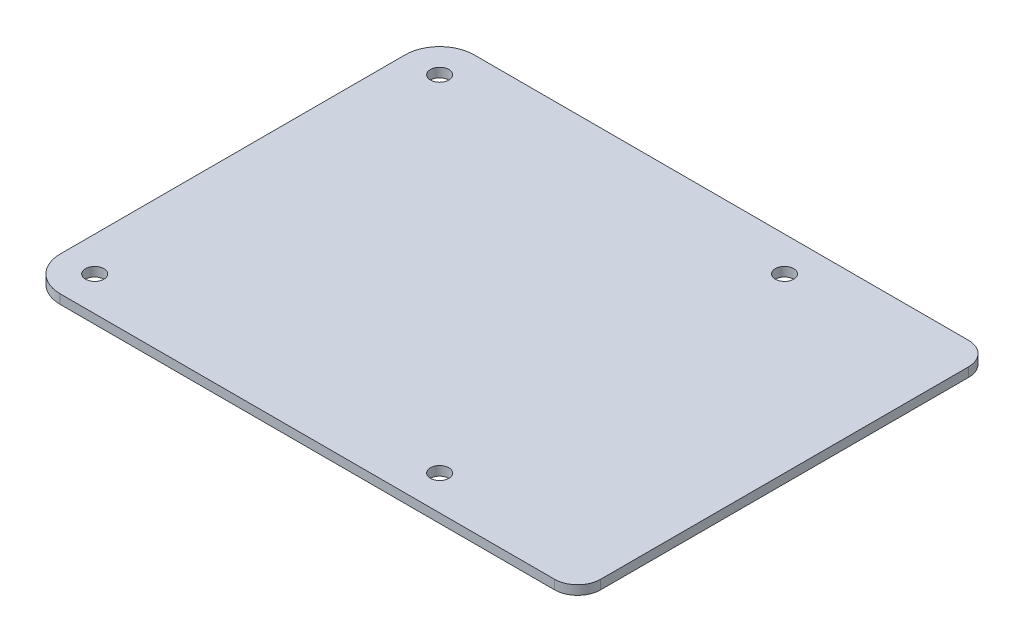
ISO-10303-21;
HEADER;
FILE_DESCRIPTION(('STEP AP214'),'2;1');
FILE_NAME('part.step','',(''),(''),'','','');
FILE_SCHEMA(('AUTOMOTIVE_DESIGN { 1 0 10303 214 1 1 1 1 }'));
ENDSEC;
DATA;
#1=APPLICATION_CONTEXT('core data for automotive mechanical design processes');
#2=APPLICATION_PROTOCOL_DEFINITION('international standard','automotive_design',2000,#1);
#3=PRODUCT_CONTEXT('',#1,'mechanical');
#4=PRODUCT('Part','Part','',(#3));
#5=PRODUCT_RELATED_PRODUCT_CATEGORY('part','',(#4));
#6=PRODUCT_DEFINITION_FORMATION('','',#4);
#7=PRODUCT_DEFINITION_CONTEXT('part definition',#1,'design');
#8=PRODUCT_DEFINITION('design','',#6,#7);
#9=PRODUCT_DEFINITION_SHAPE('','',#8);
#10=(LENGTH_UNIT() NAMED_UNIT(*) SI_UNIT(.MILLI.,.METRE.));
#11=(NAMED_UNIT(*) PLANE_ANGLE_UNIT() SI_UNIT($,.RADIAN.));
#12=(NAMED_UNIT(*) SI_UNIT($,.STERADIAN.) SOLID_ANGLE_UNIT());
#13=UNCERTAINTY_MEASURE_WITH_UNIT(LENGTH_MEASURE(1.E-05),#10,'distance_accuracy_value','');
#14=(GEOMETRIC_REPRESENTATION_CONTEXT(3) GLOBAL_UNCERTAINTY_ASSIGNED_CONTEXT((#13)) GLOBAL_UNIT_ASSIGNED_CONTEXT((#10,
#11,#12)) REPRESENTATION_CONTEXT('',''));
#15=CARTESIAN_POINT('',(0.,0.,0.));
#16=DIRECTION('',(0.,0.,1.));
#17=DIRECTION('',(1.,0.,0.));
#18=AXIS2_PLACEMENT_3D('',#15,#16,#17);
#19=CARTESIAN_POINT('',(-28.,1.6,-30.));
#20=DIRECTION('',(0.,1.,0.));
#21=DIRECTION('',(0.,0.,1.));
#22=AXIS2_PLACEMENT_3D('',#19,#20,#21);
#23=PLANE('',#22);
#24=CARTESIAN_POINT('',(32.,1.6,30.));
#25=DIRECTION('',(0.,1.,0.));
#26=DIRECTION('',(0.,0.,1.));
#27=AXIS2_PLACEMENT_3D('',#24,#25,#26);
#28=CIRCLE('',#27,1.6);
#29=CARTESIAN_POINT('',(32.,1.6,31.6));
#30=VERTEX_POINT('',#29);
#31=EDGE_CURVE('E193',#30,#30,#28,.T.);
#32=ORIENTED_EDGE('',*,*,#31,.F.);
#33=EDGE_LOOP('',(#32));
#34=FACE_BOUND('',#33,.T.);
#35=CARTESIAN_POINT('',(-28.,1.6,-30.));
#36=DIRECTION('',(0.,1.,0.));
#37=DIRECTION('',(0.,0.,1.));
#38=AXIS2_PLACEMENT_3D('',#35,#36,#37);
#39=CIRCLE('',#38,1.6);
#40=CARTESIAN_POINT('',(-28.,1.6,-28.4));
#41=VERTEX_POINT('',#40);
#42=EDGE_CURVE('E181',#41,#41,#39,.T.);
#43=ORIENTED_EDGE('',*,*,#42,.F.);
#44=EDGE_LOOP('',(#43));
#45=FACE_BOUND('',#44,.T.);
#46=DIRECTION('',(0.,0.,-1.));
#47=VECTOR('',#46,1.);
#48=CARTESIAN_POINT('',(62.,1.6,36.));
#49=LINE('',#48,#47);
#50=CARTESIAN_POINT('',(62.,1.6,32.));
#51=VERTEX_POINT('',#50);
#52=CARTESIAN_POINT('',(62.,1.6,-32.));
#53=VERTEX_POINT('',#52);
#54=EDGE_CURVE('E143',#51,#53,#49,.T.);
#55=ORIENTED_EDGE('',*,*,#54,.T.);
#56=CARTESIAN_POINT('',(58.,1.6,-32.));
#57=DIRECTION('',(0.,1.,0.));
#58=DIRECTION('',(0.,0.,1.));
#59=AXIS2_PLACEMENT_3D('',#56,#57,#58);
#60=CIRCLE('',#59,4.);
#61=CARTESIAN_POINT('',(58.,1.6,-36.));
#62=VERTEX_POINT('',#61);
#63=EDGE_CURVE('E41',#53,#62,#60,.T.);
#64=ORIENTED_EDGE('',*,*,#63,.T.);
#65=DIRECTION('',(-1.,0.,0.));
#66=VECTOR('',#65,1.);
#67=CARTESIAN_POINT('',(-28.,1.6,-36.));
#68=LINE('',#67,#66);
#69=CARTESIAN_POINT('',(-28.,1.6,-36.));
#70=VERTEX_POINT('',#69);
#71=EDGE_CURVE('E116',#62,#70,#68,.T.);
#72=ORIENTED_EDGE('',*,*,#71,.T.);
#73=CARTESIAN_POINT('',(-28.,1.6,-30.));
#74=DIRECTION('',(0.,1.,0.));
#75=DIRECTION('',(0.,0.,1.));
#76=AXIS2_PLACEMENT_3D('',#73,#74,#75);
#77=CIRCLE('',#76,5.99999999999999);
#78=CARTESIAN_POINT('',(-34.,1.6,-30.));
#79=VERTEX_POINT('',#78);
#80=EDGE_CURVE('E111',#70,#79,#77,.T.);
#81=ORIENTED_EDGE('',*,*,#80,.T.);
#82=DIRECTION('',(0.,0.,1.));
#83=VECTOR('',#82,1.);
#84=CARTESIAN_POINT('',(-34.,1.6,-30.));
#85=LINE('',#84,#83);
#86=CARTESIAN_POINT('',(-34.,1.6,30.));
#87=VERTEX_POINT('',#86);
#88=EDGE_CURVE('E100',#79,#87,#85,.T.);
#89=ORIENTED_EDGE('',*,*,#88,.T.);
#90=CARTESIAN_POINT('',(-28.,1.6,30.));
#91=DIRECTION('',(0.,1.,0.));
#92=DIRECTION('',(0.,0.,1.));
#93=AXIS2_PLACEMENT_3D('',#90,#91,#92);
#94=CIRCLE('',#93,6.);
#95=CARTESIAN_POINT('',(-28.,1.6,36.));
#96=VERTEX_POINT('',#95);
#97=EDGE_CURVE('E110',#87,#96,#94,.T.);
#98=ORIENTED_EDGE('',*,*,#97,.T.);
#99=DIRECTION('',(1.,0.,0.));
#100=VECTOR('',#99,1.);
#101=CARTESIAN_POINT('',(-28.,1.6,36.));
#102=LINE('',#101,#100);
#103=CARTESIAN_POINT('',(58.,1.6,36.));
#104=VERTEX_POINT('',#103);
#105=EDGE_CURVE('E170',#96,#104,#102,.T.);
#106=ORIENTED_EDGE('',*,*,#105,.T.);
#107=CARTESIAN_POINT('',(58.,1.6,32.));
#108=DIRECTION('',(0.,1.,0.));
#109=DIRECTION('',(0.,0.,1.));
#110=AXIS2_PLACEMENT_3D('',#107,#108,#109);
#111=CIRCLE('',#110,4.);
#112=EDGE_CURVE('E141',#104,#51,#111,.T.);
#113=ORIENTED_EDGE('',*,*,#112,.T.);
#114=EDGE_LOOP('',(#55,#64,#72,#81,#89,#98,#106,#113));
#115=FACE_BOUND('',#114,.T.);
#116=CARTESIAN_POINT('',(32.,1.6,-30.));
#117=DIRECTION('',(0.,1.,0.));
#118=DIRECTION('',(0.,0.,1.));
#119=AXIS2_PLACEMENT_3D('',#116,#117,#118);
#120=CIRCLE('',#119,1.6);
#121=CARTESIAN_POINT('',(32.,1.6,-28.4));
#122=VERTEX_POINT('',#121);
#123=EDGE_CURVE('E187',#122,#122,#120,.T.);
#124=ORIENTED_EDGE('',*,*,#123,.F.);
#125=EDGE_LOOP('',(#124));
#126=FACE_BOUND('',#125,.T.);
#127=CARTESIAN_POINT('',(-28.,1.6,30.));
#128=DIRECTION('',(0.,1.,0.));
#129=DIRECTION('',(0.,0.,1.));
#130=AXIS2_PLACEMENT_3D('',#127,#128,#129);
#131=CIRCLE('',#130,1.6);
#132=CARTESIAN_POINT('',(-28.,1.6,31.6));
#133=VERTEX_POINT('',#132);
#134=EDGE_CURVE('E199',#133,#133,#131,.T.);
#135=ORIENTED_EDGE('',*,*,#134,.F.);
#136=EDGE_LOOP('',(#135));
#137=FACE_BOUND('',#136,.T.);
#138=ADVANCED_FACE('F33',(#34,#45,#115,#126,#137),#23,.T.);
#139=CARTESIAN_POINT('',(-28.,0.,-30.));
#140=DIRECTION('',(0.,1.,0.));
#141=DIRECTION('',(0.,0.,1.));
#142=AXIS2_PLACEMENT_3D('',#139,#140,#141);
#143=PLANE('',#142);
#144=DIRECTION('',(-1.,0.,0.));
#145=VECTOR('',#144,1.);
#146=CARTESIAN_POINT('',(-28.,0.,-36.));
#147=LINE('',#146,#145);
#148=CARTESIAN_POINT('',(58.,0.,-36.));
#149=VERTEX_POINT('',#148);
#150=CARTESIAN_POINT('',(-28.,0.,-36.));
#151=VERTEX_POINT('',#150);
#152=EDGE_CURVE('E120',#149,#151,#147,.T.);
#153=ORIENTED_EDGE('',*,*,#152,.F.);
#154=CARTESIAN_POINT('',(58.,0.,-32.));
#155=DIRECTION('',(0.,1.,0.));
#156=DIRECTION('',(0.,0.,1.));
#157=AXIS2_PLACEMENT_3D('',#154,#155,#156);
#158=CIRCLE('',#157,4.);
#159=CARTESIAN_POINT('',(62.,0.,-32.));
#160=VERTEX_POINT('',#159);
#161=EDGE_CURVE('E135',#149,#160,#158,.F.);
#162=ORIENTED_EDGE('',*,*,#161,.T.);
#163=DIRECTION('',(0.,0.,-1.));
#164=VECTOR('',#163,1.);
#165=CARTESIAN_POINT('',(62.,0.,36.));
#166=LINE('',#165,#164);
#167=CARTESIAN_POINT('',(62.,0.,32.));
#168=VERTEX_POINT('',#167);
#169=EDGE_CURVE('E156',#168,#160,#166,.T.);
#170=ORIENTED_EDGE('',*,*,#169,.F.);
#171=CARTESIAN_POINT('',(58.,0.,32.));
#172=DIRECTION('',(0.,1.,0.));
#173=DIRECTION('',(0.,0.,1.));
#174=AXIS2_PLACEMENT_3D('',#171,#172,#173);
#175=CIRCLE('',#174,4.);
#176=CARTESIAN_POINT('',(58.,0.,36.));
#177=VERTEX_POINT('',#176);
#178=EDGE_CURVE('E128',#168,#177,#175,.F.);
#179=ORIENTED_EDGE('',*,*,#178,.T.);
#180=DIRECTION('',(1.,0.,0.));
#181=VECTOR('',#180,1.);
#182=CARTESIAN_POINT('',(-28.,0.,36.));
#183=LINE('',#182,#181);
#184=CARTESIAN_POINT('',(-28.,0.,36.));
#185=VERTEX_POINT('',#184);
#186=EDGE_CURVE('E159',#185,#177,#183,.T.);
#187=ORIENTED_EDGE('',*,*,#186,.F.);
#188=CARTESIAN_POINT('',(-28.,0.,30.));
#189=DIRECTION('',(0.,1.,0.));
#190=DIRECTION('',(0.,0.,1.));
#191=AXIS2_PLACEMENT_3D('',#188,#189,#190);
#192=CIRCLE('',#191,6.);
#193=CARTESIAN_POINT('',(-34.,0.,30.));
#194=VERTEX_POINT('',#193);
#195=EDGE_CURVE('E162',#194,#185,#192,.T.);
#196=ORIENTED_EDGE('',*,*,#195,.F.);
#197=DIRECTION('',(0.,0.,1.));
#198=VECTOR('',#197,1.);
#199=CARTESIAN_POINT('',(-34.,0.,-30.));
#200=LINE('',#199,#198);
#201=CARTESIAN_POINT('',(-34.,0.,-30.));
#202=VERTEX_POINT('',#201);
#203=EDGE_CURVE('E180',#202,#194,#200,.T.);
#204=ORIENTED_EDGE('',*,*,#203,.F.);
#205=CARTESIAN_POINT('',(-28.,0.,-30.));
#206=DIRECTION('',(0.,1.,0.));
#207=DIRECTION('',(0.,0.,1.));
#208=AXIS2_PLACEMENT_3D('',#205,#206,#207);
#209=CIRCLE('',#208,5.99999999999999);
#210=EDGE_CURVE('E124',#151,#202,#209,.T.);
#211=ORIENTED_EDGE('',*,*,#210,.F.);
#212=EDGE_LOOP('',(#153,#162,#170,#179,#187,#196,#204,#211));
#213=FACE_BOUND('',#212,.T.);
#214=CARTESIAN_POINT('',(-28.,0.,-30.));
#215=DIRECTION('',(0.,1.,0.));
#216=DIRECTION('',(0.,0.,1.));
#217=AXIS2_PLACEMENT_3D('',#214,#215,#216);
#218=CIRCLE('',#217,1.6);
#219=CARTESIAN_POINT('',(-28.,0.,-28.4));
#220=VERTEX_POINT('',#219);
#221=EDGE_CURVE('E184',#220,#220,#218,.T.);
#222=ORIENTED_EDGE('',*,*,#221,.T.);
#223=EDGE_LOOP('',(#222));
#224=FACE_BOUND('',#223,.T.);
#225=CARTESIAN_POINT('',(32.,0.,-30.));
#226=DIRECTION('',(0.,1.,0.));
#227=DIRECTION('',(0.,0.,1.));
#228=AXIS2_PLACEMENT_3D('',#225,#226,#227);
#229=CIRCLE('',#228,1.6);
#230=CARTESIAN_POINT('',(32.,0.,-28.4));
#231=VERTEX_POINT('',#230);
#232=EDGE_CURVE('E190',#231,#231,#229,.T.);
#233=ORIENTED_EDGE('',*,*,#232,.T.);
#234=EDGE_LOOP('',(#233));
#235=FACE_BOUND('',#234,.T.);
#236=CARTESIAN_POINT('',(32.,0.,30.));
#237=DIRECTION('',(0.,1.,0.));
#238=DIRECTION('',(0.,0.,1.));
#239=AXIS2_PLACEMENT_3D('',#236,#237,#238);
#240=CIRCLE('',#239,1.6);
#241=CARTESIAN_POINT('',(32.,0.,31.6));
#242=VERTEX_POINT('',#241);
#243=EDGE_CURVE('E196',#242,#242,#240,.T.);
#244=ORIENTED_EDGE('',*,*,#243,.T.);
#245=EDGE_LOOP('',(#244));
#246=FACE_BOUND('',#245,.T.);
#247=CARTESIAN_POINT('',(-28.,0.,30.));
#248=DIRECTION('',(0.,1.,0.));
#249=DIRECTION('',(0.,0.,1.));
#250=AXIS2_PLACEMENT_3D('',#247,#248,#249);
#251=CIRCLE('',#250,1.6);
#252=CARTESIAN_POINT('',(-28.,0.,31.6));
#253=VERTEX_POINT('',#252);
#254=EDGE_CURVE('E202',#253,#253,#251,.T.);
#255=ORIENTED_EDGE('',*,*,#254,.T.);
#256=EDGE_LOOP('',(#255));
#257=FACE_BOUND('',#256,.T.);
#258=ADVANCED_FACE('F154',(#213,#224,#235,#246,#257),#143,.F.);
#259=CARTESIAN_POINT('',(-28.,1.6,-30.));
#260=DIRECTION('',(0.,-1.,0.));
#261=DIRECTION('',(0.,0.,-1.));
#262=AXIS2_PLACEMENT_3D('',#259,#260,#261);
#263=CYLINDRICAL_SURFACE('',#262,5.99999999999999);
#264=ORIENTED_EDGE('',*,*,#210,.T.);
#265=DIRECTION('',(0.,-1.,0.));
#266=VECTOR('',#265,1.);
#267=CARTESIAN_POINT('',(-34.,1.6,-30.));
#268=LINE('',#267,#266);
#269=EDGE_CURVE('E104',#79,#202,#268,.T.);
#270=ORIENTED_EDGE('',*,*,#269,.F.);
#271=ORIENTED_EDGE('',*,*,#80,.F.);
#272=DIRECTION('',(0.,-1.,0.));
#273=VECTOR('',#272,1.);
#274=CARTESIAN_POINT('',(-28.,1.6,-36.));
#275=LINE('',#274,#273);
#276=EDGE_CURVE('E149',#70,#151,#275,.T.);
#277=ORIENTED_EDGE('',*,*,#276,.T.);
#278=EDGE_LOOP('',(#264,#270,#271,#277));
#279=FACE_BOUND('',#278,.T.);
#280=ADVANCED_FACE('F122',(#279),#263,.T.);
#281=CARTESIAN_POINT('',(-34.,1.6,-30.));
#282=DIRECTION('',(1.,0.,0.));
#283=DIRECTION('',(0.,0.,-1.));
#284=AXIS2_PLACEMENT_3D('',#281,#282,#283);
#285=PLANE('',#284);
#286=ORIENTED_EDGE('',*,*,#203,.T.);
#287=DIRECTION('',(0.,-1.,0.));
#288=VECTOR('',#287,1.);
#289=CARTESIAN_POINT('',(-34.,1.6,30.));
#290=LINE('',#289,#288);
#291=EDGE_CURVE('E107',#87,#194,#290,.T.);
#292=ORIENTED_EDGE('',*,*,#291,.F.);
#293=ORIENTED_EDGE('',*,*,#88,.F.);
#294=ORIENTED_EDGE('',*,*,#269,.T.);
#295=EDGE_LOOP('',(#286,#292,#293,#294));
#296=FACE_BOUND('',#295,.T.);
#297=ADVANCED_FACE('F102',(#296),#285,.F.);
#298=CARTESIAN_POINT('',(-28.,1.6,30.));
#299=DIRECTION('',(0.,-1.,0.));
#300=DIRECTION('',(0.,0.,-1.));
#301=AXIS2_PLACEMENT_3D('',#298,#299,#300);
#302=CYLINDRICAL_SURFACE('',#301,6.);
#303=ORIENTED_EDGE('',*,*,#195,.T.);
#304=DIRECTION('',(0.,-1.,0.));
#305=VECTOR('',#304,1.);
#306=CARTESIAN_POINT('',(-28.,1.6,36.));
#307=LINE('',#306,#305);
#308=EDGE_CURVE('E130',#96,#185,#307,.T.);
#309=ORIENTED_EDGE('',*,*,#308,.F.);
#310=ORIENTED_EDGE('',*,*,#97,.F.);
#311=ORIENTED_EDGE('',*,*,#291,.T.);
#312=EDGE_LOOP('',(#303,#309,#310,#311));
#313=FACE_BOUND('',#312,.T.);
#314=ADVANCED_FACE('F182',(#313),#302,.T.);
#315=CARTESIAN_POINT('',(-28.,1.6,36.));
#316=DIRECTION('',(0.,0.,-1.));
#317=DIRECTION('',(-1.,0.,0.));
#318=AXIS2_PLACEMENT_3D('',#315,#316,#317);
#319=PLANE('',#318);
#320=ORIENTED_EDGE('',*,*,#186,.T.);
#321=DIRECTION('',(0.,-1.,0.));
#322=VECTOR('',#321,1.);
#323=CARTESIAN_POINT('',(58.,1.6,36.));
#324=LINE('',#323,#322);
#325=EDGE_CURVE('E11',#177,#104,#324,.F.);
#326=ORIENTED_EDGE('',*,*,#325,.T.);
#327=ORIENTED_EDGE('',*,*,#105,.F.);
#328=ORIENTED_EDGE('',*,*,#308,.T.);
#329=EDGE_LOOP('',(#320,#326,#327,#328));
#330=FACE_BOUND('',#329,.T.);
#331=ADVANCED_FACE('F169',(#330),#319,.F.);
#332=CARTESIAN_POINT('',(62.,1.6,36.));
#333=DIRECTION('',(-1.,0.,0.));
#334=DIRECTION('',(0.,0.,1.));
#335=AXIS2_PLACEMENT_3D('',#332,#333,#334);
#336=PLANE('',#335);
#337=ORIENTED_EDGE('',*,*,#169,.T.);
#338=DIRECTION('',(0.,-1.,0.));
#339=VECTOR('',#338,1.);
#340=CARTESIAN_POINT('',(62.,1.6,-32.));
#341=LINE('',#340,#339);
#342=EDGE_CURVE('E54',#160,#53,#341,.F.);
#343=ORIENTED_EDGE('',*,*,#342,.T.);
#344=ORIENTED_EDGE('',*,*,#54,.F.);
#345=DIRECTION('',(0.,-1.,0.));
#346=VECTOR('',#345,1.);
#347=CARTESIAN_POINT('',(62.,1.6,32.));
#348=LINE('',#347,#346);
#349=EDGE_CURVE('E137',#51,#168,#348,.T.);
#350=ORIENTED_EDGE('',*,*,#349,.T.);
#351=EDGE_LOOP('',(#337,#343,#344,#350));
#352=FACE_BOUND('',#351,.T.);
#353=ADVANCED_FACE('F157',(#352),#336,.F.);
#354=CARTESIAN_POINT('',(-28.,1.6,-36.));
#355=DIRECTION('',(0.,0.,1.));
#356=DIRECTION('',(1.,0.,0.));
#357=AXIS2_PLACEMENT_3D('',#354,#355,#356);
#358=PLANE('',#357);
#359=ORIENTED_EDGE('',*,*,#71,.F.);
#360=DIRECTION('',(0.,-1.,0.));
#361=VECTOR('',#360,1.);
#362=CARTESIAN_POINT('',(58.,1.6,-36.));
#363=LINE('',#362,#361);
#364=EDGE_CURVE('E125',#62,#149,#363,.T.);
#365=ORIENTED_EDGE('',*,*,#364,.T.);
#366=ORIENTED_EDGE('',*,*,#152,.T.);
#367=ORIENTED_EDGE('',*,*,#276,.F.);
#368=EDGE_LOOP('',(#359,#365,#366,#367));
#369=FACE_BOUND('',#368,.T.);
#370=ADVANCED_FACE('F147',(#369),#358,.F.);
#371=CARTESIAN_POINT('',(-28.,1.6,-30.));
#372=DIRECTION('',(0.,-1.,0.));
#373=DIRECTION('',(0.,0.,-1.));
#374=AXIS2_PLACEMENT_3D('',#371,#372,#373);
#375=CYLINDRICAL_SURFACE('',#374,1.6);
#376=ORIENTED_EDGE('',*,*,#42,.T.);
#377=EDGE_LOOP('',(#376));
#378=FACE_BOUND('',#377,.T.);
#379=ORIENTED_EDGE('',*,*,#221,.F.);
#380=EDGE_LOOP('',(#379));
#381=FACE_BOUND('',#380,.T.);
#382=ADVANCED_FACE('F221',(#378,#381),#375,.F.);
#383=CARTESIAN_POINT('',(32.,1.6,-30.));
#384=DIRECTION('',(0.,-1.,0.));
#385=DIRECTION('',(0.,0.,-1.));
#386=AXIS2_PLACEMENT_3D('',#383,#384,#385);
#387=CYLINDRICAL_SURFACE('',#386,1.6);
#388=ORIENTED_EDGE('',*,*,#123,.T.);
#389=EDGE_LOOP('',(#388));
#390=FACE_BOUND('',#389,.T.);
#391=ORIENTED_EDGE('',*,*,#232,.F.);
#392=EDGE_LOOP('',(#391));
#393=FACE_BOUND('',#392,.T.);
#394=ADVANCED_FACE('F245',(#390,#393),#387,.F.);
#395=CARTESIAN_POINT('',(32.,1.6,30.));
#396=DIRECTION('',(0.,-1.,0.));
#397=DIRECTION('',(0.,0.,-1.));
#398=AXIS2_PLACEMENT_3D('',#395,#396,#397);
#399=CYLINDRICAL_SURFACE('',#398,1.6);
#400=ORIENTED_EDGE('',*,*,#31,.T.);
#401=EDGE_LOOP('',(#400));
#402=FACE_BOUND('',#401,.T.);
#403=ORIENTED_EDGE('',*,*,#243,.F.);
#404=EDGE_LOOP('',(#403));
#405=FACE_BOUND('',#404,.T.);
#406=ADVANCED_FACE('F240',(#402,#405),#399,.F.);
#407=CARTESIAN_POINT('',(-28.,1.6,30.));
#408=DIRECTION('',(0.,-1.,0.));
#409=DIRECTION('',(0.,0.,-1.));
#410=AXIS2_PLACEMENT_3D('',#407,#408,#409);
#411=CYLINDRICAL_SURFACE('',#410,1.6);
#412=ORIENTED_EDGE('',*,*,#134,.T.);
#413=EDGE_LOOP('',(#412));
#414=FACE_BOUND('',#413,.T.);
#415=ORIENTED_EDGE('',*,*,#254,.F.);
#416=EDGE_LOOP('',(#415));
#417=FACE_BOUND('',#416,.T.);
#418=ADVANCED_FACE('F208',(#414,#417),#411,.F.);
#419=CARTESIAN_POINT('',(58.,1.6,-32.));
#420=DIRECTION('',(0.,-1.,0.));
#421=DIRECTION('',(0.,0.,-1.));
#422=AXIS2_PLACEMENT_3D('',#419,#420,#421);
#423=CYLINDRICAL_SURFACE('',#422,4.);
#424=ORIENTED_EDGE('',*,*,#63,.F.);
#425=ORIENTED_EDGE('',*,*,#342,.F.);
#426=ORIENTED_EDGE('',*,*,#161,.F.);
#427=ORIENTED_EDGE('',*,*,#364,.F.);
#428=EDGE_LOOP('',(#424,#425,#426,#427));
#429=FACE_BOUND('',#428,.T.);
#430=ADVANCED_FACE('F151',(#429),#423,.T.);
#431=CARTESIAN_POINT('',(58.,1.6,32.));
#432=DIRECTION('',(0.,-1.,0.));
#433=DIRECTION('',(0.,0.,-1.));
#434=AXIS2_PLACEMENT_3D('',#431,#432,#433);
#435=CYLINDRICAL_SURFACE('',#434,4.);
#436=ORIENTED_EDGE('',*,*,#112,.F.);
#437=ORIENTED_EDGE('',*,*,#325,.F.);
#438=ORIENTED_EDGE('',*,*,#178,.F.);
#439=ORIENTED_EDGE('',*,*,#349,.F.);
#440=EDGE_LOOP('',(#436,#437,#438,#439));
#441=FACE_BOUND('',#440,.T.);
#442=ADVANCED_FACE('F35',(#441),#435,.T.);
#443=CLOSED_SHELL('',(#138,#258,#280,#297,#314,#331,#353,#370,#382,#394,#406,#418,#430,#442));
#444=MANIFOLD_SOLID_BREP('B2',#443);
#445=ADVANCED_BREP_SHAPE_REPRESENTATION('',(#18,#444),#14);
#446=SHAPE_DEFINITION_REPRESENTATION(#9,#445);
ENDSEC;
END-ISO-10303-21;
